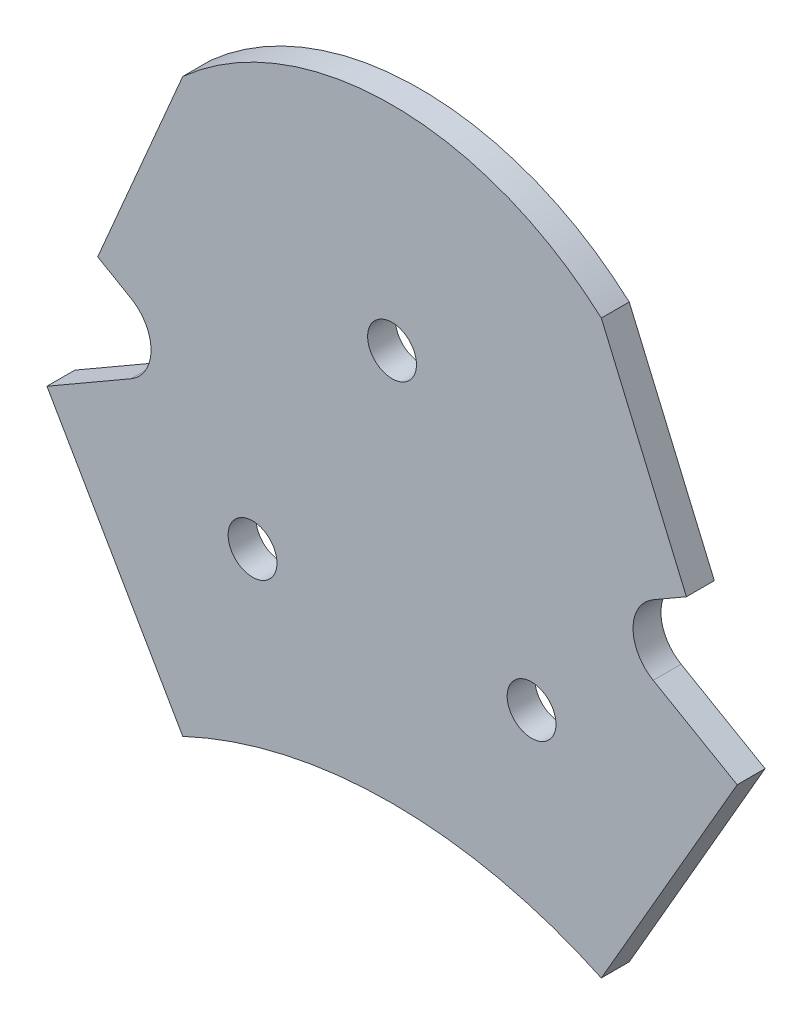
ISO-10303-21;
HEADER;
FILE_DESCRIPTION(('STEP AP214'),'2;1');
FILE_NAME('part.step','',(''),(''),'','','');
FILE_SCHEMA(('AUTOMOTIVE_DESIGN { 1 0 10303 214 1 1 1 1 }'));
ENDSEC;
DATA;
#1=APPLICATION_CONTEXT('core data for automotive mechanical design processes');
#2=APPLICATION_PROTOCOL_DEFINITION('international standard','automotive_design',2000,#1);
#3=PRODUCT_CONTEXT('',#1,'mechanical');
#4=PRODUCT('Part','Part','',(#3));
#5=PRODUCT_RELATED_PRODUCT_CATEGORY('part','',(#4));
#6=PRODUCT_DEFINITION_FORMATION('','',#4);
#7=PRODUCT_DEFINITION_CONTEXT('part definition',#1,'design');
#8=PRODUCT_DEFINITION('design','',#6,#7);
#9=PRODUCT_DEFINITION_SHAPE('','',#8);
#10=(LENGTH_UNIT() NAMED_UNIT(*) SI_UNIT(.MILLI.,.METRE.));
#11=(NAMED_UNIT(*) PLANE_ANGLE_UNIT() SI_UNIT($,.RADIAN.));
#12=(NAMED_UNIT(*) SI_UNIT($,.STERADIAN.) SOLID_ANGLE_UNIT());
#13=UNCERTAINTY_MEASURE_WITH_UNIT(LENGTH_MEASURE(1.E-05),#10,'distance_accuracy_value','');
#14=(GEOMETRIC_REPRESENTATION_CONTEXT(3) GLOBAL_UNCERTAINTY_ASSIGNED_CONTEXT((#13)) GLOBAL_UNIT_ASSIGNED_CONTEXT((#10,
#11,#12)) REPRESENTATION_CONTEXT('',''));
#15=CARTESIAN_POINT('',(0.,0.,0.));
#16=DIRECTION('',(0.,0.,1.));
#17=DIRECTION('',(1.,0.,0.));
#18=AXIS2_PLACEMENT_3D('',#15,#16,#17);
#19=CARTESIAN_POINT('',(0.,8.63401265472819,4.));
#20=DIRECTION('',(0.,0.,-1.));
#21=DIRECTION('',(-1.,0.,0.));
#22=AXIS2_PLACEMENT_3D('',#19,#20,#21);
#23=PLANE('',#22);
#24=DIRECTION('',(-0.866025403784439,0.499999999999999,0.));
#25=VECTOR('',#24,1.);
#26=CARTESIAN_POINT('',(-37.4352447854375,10.8722325026744,4.));
#27=LINE('',#26,#25);
#28=CARTESIAN_POINT('',(-37.4352447854375,10.8722325026744,4.));
#29=VERTEX_POINT('',#28);
#30=CARTESIAN_POINT('',(-42.1983845062519,13.6222325026743,4.));
#31=VERTEX_POINT('',#30);
#32=EDGE_CURVE('E323',#29,#31,#27,.T.);
#33=ORIENTED_EDGE('',*,*,#32,.F.);
#34=CARTESIAN_POINT('',(-40.3219961313856,5.87223250267436,4.));
#35=DIRECTION('',(0.,0.,1.));
#36=DIRECTION('',(1.,0.,0.));
#37=AXIS2_PLACEMENT_3D('',#34,#35,#36);
#38=CIRCLE('',#37,5.77350269189626);
#39=CARTESIAN_POINT('',(-37.4352447854375,0.872232502674344,4.));
#40=VERTEX_POINT('',#39);
#41=EDGE_CURVE('E268',#40,#29,#38,.T.);
#42=ORIENTED_EDGE('',*,*,#41,.F.);
#43=DIRECTION('',(0.866025403784439,0.499999999999999,0.));
#44=VECTOR('',#43,1.);
#45=CARTESIAN_POINT('',(-49.4729978980412,-6.07776749732564,4.));
#46=LINE('',#45,#44);
#47=CARTESIAN_POINT('',(-49.4729978980412,-6.07776749732564,4.));
#48=VERTEX_POINT('',#47);
#49=EDGE_CURVE('E254',#48,#40,#46,.T.);
#50=ORIENTED_EDGE('',*,*,#49,.F.);
#51=DIRECTION('',(-0.5,0.866025403784439,0.));
#52=VECTOR('',#51,1.);
#53=CARTESIAN_POINT('',(-30.,-39.805989232415,4.));
#54=LINE('',#53,#52);
#55=CARTESIAN_POINT('',(-30.,-39.805989232415,4.));
#56=VERTEX_POINT('',#55);
#57=EDGE_CURVE('E267',#56,#48,#54,.T.);
#58=ORIENTED_EDGE('',*,*,#57,.F.);
#59=CARTESIAN_POINT('',(0.,-103.620168336893,4.));
#60=DIRECTION('',(0.,0.,-1.));
#61=DIRECTION('',(-1.,0.,0.));
#62=AXIS2_PLACEMENT_3D('',#59,#60,#61);
#63=CIRCLE('',#62,70.5141791044776);
#64=CARTESIAN_POINT('',(30.,-39.805989232415,4.));
#65=VERTEX_POINT('',#64);
#66=EDGE_CURVE('E274',#56,#65,#63,.T.);
#67=ORIENTED_EDGE('',*,*,#66,.T.);
#68=DIRECTION('',(0.5,0.866025403784439,0.));
#69=VECTOR('',#68,1.);
#70=CARTESIAN_POINT('',(30.,-39.805989232415,4.));
#71=LINE('',#70,#69);
#72=CARTESIAN_POINT('',(49.4729978980412,-6.07776749732566,4.));
#73=VERTEX_POINT('',#72);
#74=EDGE_CURVE('E277',#65,#73,#71,.T.);
#75=ORIENTED_EDGE('',*,*,#74,.T.);
#76=DIRECTION('',(-0.866025403784439,0.5,0.));
#77=VECTOR('',#76,1.);
#78=CARTESIAN_POINT('',(49.4729978980412,-6.07776749732566,4.));
#79=LINE('',#78,#77);
#80=CARTESIAN_POINT('',(37.4352447854375,0.872232502674349,4.));
#81=VERTEX_POINT('',#80);
#82=EDGE_CURVE('E434',#73,#81,#79,.T.);
#83=ORIENTED_EDGE('',*,*,#82,.T.);
#84=CARTESIAN_POINT('',(40.3219961313856,5.87223250267436,4.));
#85=DIRECTION('',(0.,0.,-1.));
#86=DIRECTION('',(-1.,0.,0.));
#87=AXIS2_PLACEMENT_3D('',#84,#85,#86);
#88=CIRCLE('',#87,5.77350269189627);
#89=CARTESIAN_POINT('',(37.4352447854375,10.8722325026744,4.));
#90=VERTEX_POINT('',#89);
#91=EDGE_CURVE('E431',#81,#90,#88,.T.);
#92=ORIENTED_EDGE('',*,*,#91,.T.);
#93=DIRECTION('',(0.866025403784441,0.499999999999996,0.));
#94=VECTOR('',#93,1.);
#95=CARTESIAN_POINT('',(37.4352447854375,10.8722325026744,4.));
#96=LINE('',#95,#94);
#97=CARTESIAN_POINT('',(42.1983845062519,13.6222325026743,4.));
#98=VERTEX_POINT('',#97);
#99=EDGE_CURVE('E428',#90,#98,#96,.T.);
#100=ORIENTED_EDGE('',*,*,#99,.T.);
#101=DIRECTION('',(-0.393496274395222,0.919326210894196,0.));
#102=VECTOR('',#101,1.);
#103=CARTESIAN_POINT('',(42.1983845062519,13.6222325026743,4.));
#104=LINE('',#103,#102);
#105=CARTESIAN_POINT('',(30.,42.1213450403944,4.));
#106=VERTEX_POINT('',#105);
#107=EDGE_CURVE('E425',#98,#106,#104,.T.);
#108=ORIENTED_EDGE('',*,*,#107,.T.);
#109=CARTESIAN_POINT('',(0.,8.63401265472819,4.));
#110=DIRECTION('',(0.,0.,-1.));
#111=DIRECTION('',(-1.,0.,0.));
#112=AXIS2_PLACEMENT_3D('',#109,#110,#111);
#113=CIRCLE('',#112,44.9599981128569);
#114=CARTESIAN_POINT('',(-30.,42.1213450403944,4.));
#115=VERTEX_POINT('',#114);
#116=EDGE_CURVE('E421',#115,#106,#113,.T.);
#117=ORIENTED_EDGE('',*,*,#116,.F.);
#118=DIRECTION('',(0.393496274395222,0.919326210894196,0.));
#119=VECTOR('',#118,1.);
#120=CARTESIAN_POINT('',(-42.1983845062519,13.6222325026743,4.));
#121=LINE('',#120,#119);
#122=EDGE_CURVE('E418',#31,#115,#121,.T.);
#123=ORIENTED_EDGE('',*,*,#122,.F.);
#124=EDGE_LOOP('',(#33,#42,#50,#58,#67,#75,#83,#92,#100,#108,#117,#123));
#125=FACE_BOUND('',#124,.T.);
#126=CARTESIAN_POINT('',(0.,23.094010767585,4.));
#127=DIRECTION('',(0.,0.,1.));
#128=DIRECTION('',(1.,0.,0.));
#129=AXIS2_PLACEMENT_3D('',#126,#127,#128);
#130=CIRCLE('',#129,3.5);
#131=CARTESIAN_POINT('',(3.5,23.094010767585,4.));
#132=VERTEX_POINT('',#131);
#133=EDGE_CURVE('E288',#132,#132,#130,.T.);
#134=ORIENTED_EDGE('',*,*,#133,.F.);
#135=EDGE_LOOP('',(#134));
#136=FACE_BOUND('',#135,.T.);
#137=CARTESIAN_POINT('',(-20.,-11.5470053837925,4.));
#138=DIRECTION('',(0.,0.,1.));
#139=DIRECTION('',(1.,0.,0.));
#140=AXIS2_PLACEMENT_3D('',#137,#138,#139);
#141=CIRCLE('',#140,3.5);
#142=CARTESIAN_POINT('',(-16.5,-11.5470053837925,4.));
#143=VERTEX_POINT('',#142);
#144=EDGE_CURVE('E402',#143,#143,#141,.T.);
#145=ORIENTED_EDGE('',*,*,#144,.F.);
#146=EDGE_LOOP('',(#145));
#147=FACE_BOUND('',#146,.T.);
#148=CARTESIAN_POINT('',(20.,-11.5470053837925,4.));
#149=DIRECTION('',(0.,0.,1.));
#150=DIRECTION('',(1.,0.,0.));
#151=AXIS2_PLACEMENT_3D('',#148,#149,#150);
#152=CIRCLE('',#151,3.5);
#153=CARTESIAN_POINT('',(23.5,-11.5470053837925,4.));
#154=VERTEX_POINT('',#153);
#155=EDGE_CURVE('E391',#154,#154,#152,.T.);
#156=ORIENTED_EDGE('',*,*,#155,.F.);
#157=EDGE_LOOP('',(#156));
#158=FACE_BOUND('',#157,.T.);
#159=ADVANCED_FACE('F156',(#125,#136,#147,#158),#23,.F.);
#160=CARTESIAN_POINT('',(0.,8.63401265472819,0.));
#161=DIRECTION('',(0.,0.,-1.));
#162=DIRECTION('',(-1.,0.,0.));
#163=AXIS2_PLACEMENT_3D('',#160,#161,#162);
#164=PLANE('',#163);
#165=CARTESIAN_POINT('',(-20.,-11.5470053837925,0.));
#166=DIRECTION('',(0.,0.,1.));
#167=DIRECTION('',(1.,0.,0.));
#168=AXIS2_PLACEMENT_3D('',#165,#166,#167);
#169=CIRCLE('',#168,3.5);
#170=CARTESIAN_POINT('',(-16.5,-11.5470053837925,0.));
#171=VERTEX_POINT('',#170);
#172=EDGE_CURVE('E399',#171,#171,#169,.T.);
#173=ORIENTED_EDGE('',*,*,#172,.T.);
#174=EDGE_LOOP('',(#173));
#175=FACE_BOUND('',#174,.T.);
#176=DIRECTION('',(-0.866025403784439,0.499999999999999,0.));
#177=VECTOR('',#176,1.);
#178=CARTESIAN_POINT('',(-37.4352447854375,10.8722325026744,0.));
#179=LINE('',#178,#177);
#180=CARTESIAN_POINT('',(-37.4352447854375,10.8722325026744,0.));
#181=VERTEX_POINT('',#180);
#182=CARTESIAN_POINT('',(-42.1983845062519,13.6222325026743,0.));
#183=VERTEX_POINT('',#182);
#184=EDGE_CURVE('E283',#181,#183,#179,.T.);
#185=ORIENTED_EDGE('',*,*,#184,.T.);
#186=DIRECTION('',(0.393496274395222,0.919326210894196,0.));
#187=VECTOR('',#186,1.);
#188=CARTESIAN_POINT('',(-42.1983845062519,13.6222325026743,0.));
#189=LINE('',#188,#187);
#190=CARTESIAN_POINT('',(-30.,42.1213450403944,0.));
#191=VERTEX_POINT('',#190);
#192=EDGE_CURVE('E287',#183,#191,#189,.T.);
#193=ORIENTED_EDGE('',*,*,#192,.T.);
#194=CARTESIAN_POINT('',(0.,8.63401265472819,0.));
#195=DIRECTION('',(0.,0.,-1.));
#196=DIRECTION('',(-1.,0.,0.));
#197=AXIS2_PLACEMENT_3D('',#194,#195,#196);
#198=CIRCLE('',#197,44.9599981128569);
#199=CARTESIAN_POINT('',(30.,42.1213450403944,0.));
#200=VERTEX_POINT('',#199);
#201=EDGE_CURVE('E292',#191,#200,#198,.T.);
#202=ORIENTED_EDGE('',*,*,#201,.T.);
#203=DIRECTION('',(-0.393496274395222,0.919326210894196,0.));
#204=VECTOR('',#203,1.);
#205=CARTESIAN_POINT('',(42.1983845062519,13.6222325026743,0.));
#206=LINE('',#205,#204);
#207=CARTESIAN_POINT('',(42.1983845062519,13.6222325026743,0.));
#208=VERTEX_POINT('',#207);
#209=EDGE_CURVE('E296',#208,#200,#206,.T.);
#210=ORIENTED_EDGE('',*,*,#209,.F.);
#211=DIRECTION('',(0.866025403784441,0.499999999999996,0.));
#212=VECTOR('',#211,1.);
#213=CARTESIAN_POINT('',(37.4352447854375,10.8722325026744,0.));
#214=LINE('',#213,#212);
#215=CARTESIAN_POINT('',(37.4352447854375,10.8722325026744,0.));
#216=VERTEX_POINT('',#215);
#217=EDGE_CURVE('E300',#216,#208,#214,.T.);
#218=ORIENTED_EDGE('',*,*,#217,.F.);
#219=CARTESIAN_POINT('',(40.3219961313856,5.87223250267436,0.));
#220=DIRECTION('',(0.,0.,-1.));
#221=DIRECTION('',(-1.,0.,0.));
#222=AXIS2_PLACEMENT_3D('',#219,#220,#221);
#223=CIRCLE('',#222,5.77350269189627);
#224=CARTESIAN_POINT('',(37.4352447854375,0.872232502674349,0.));
#225=VERTEX_POINT('',#224);
#226=EDGE_CURVE('E303',#225,#216,#223,.T.);
#227=ORIENTED_EDGE('',*,*,#226,.F.);
#228=DIRECTION('',(-0.866025403784439,0.5,0.));
#229=VECTOR('',#228,1.);
#230=CARTESIAN_POINT('',(49.4729978980412,-6.07776749732566,0.));
#231=LINE('',#230,#229);
#232=CARTESIAN_POINT('',(49.4729978980412,-6.07776749732566,0.));
#233=VERTEX_POINT('',#232);
#234=EDGE_CURVE('E306',#233,#225,#231,.T.);
#235=ORIENTED_EDGE('',*,*,#234,.F.);
#236=DIRECTION('',(0.5,0.866025403784439,0.));
#237=VECTOR('',#236,1.);
#238=CARTESIAN_POINT('',(30.,-39.805989232415,0.));
#239=LINE('',#238,#237);
#240=CARTESIAN_POINT('',(30.,-39.805989232415,0.));
#241=VERTEX_POINT('',#240);
#242=EDGE_CURVE('E309',#241,#233,#239,.T.);
#243=ORIENTED_EDGE('',*,*,#242,.F.);
#244=CARTESIAN_POINT('',(0.,-103.620168336893,0.));
#245=DIRECTION('',(0.,0.,-1.));
#246=DIRECTION('',(-1.,0.,0.));
#247=AXIS2_PLACEMENT_3D('',#244,#245,#246);
#248=CIRCLE('',#247,70.5141791044776);
#249=CARTESIAN_POINT('',(-30.,-39.805989232415,0.));
#250=VERTEX_POINT('',#249);
#251=EDGE_CURVE('E312',#250,#241,#248,.T.);
#252=ORIENTED_EDGE('',*,*,#251,.F.);
#253=DIRECTION('',(-0.5,0.866025403784439,0.));
#254=VECTOR('',#253,1.);
#255=CARTESIAN_POINT('',(-30.,-39.805989232415,0.));
#256=LINE('',#255,#254);
#257=CARTESIAN_POINT('',(-49.4729978980412,-6.07776749732564,0.));
#258=VERTEX_POINT('',#257);
#259=EDGE_CURVE('E315',#250,#258,#256,.T.);
#260=ORIENTED_EDGE('',*,*,#259,.T.);
#261=DIRECTION('',(0.866025403784439,0.499999999999999,0.));
#262=VECTOR('',#261,1.);
#263=CARTESIAN_POINT('',(-49.4729978980412,-6.07776749732564,0.));
#264=LINE('',#263,#262);
#265=CARTESIAN_POINT('',(-37.4352447854375,0.872232502674344,0.));
#266=VERTEX_POINT('',#265);
#267=EDGE_CURVE('E256',#258,#266,#264,.T.);
#268=ORIENTED_EDGE('',*,*,#267,.T.);
#269=CARTESIAN_POINT('',(-40.3219961313856,5.87223250267436,0.));
#270=DIRECTION('',(0.,0.,1.));
#271=DIRECTION('',(1.,0.,0.));
#272=AXIS2_PLACEMENT_3D('',#269,#270,#271);
#273=CIRCLE('',#272,5.77350269189626);
#274=EDGE_CURVE('E320',#266,#181,#273,.T.);
#275=ORIENTED_EDGE('',*,*,#274,.T.);
#276=EDGE_LOOP('',(#185,#193,#202,#210,#218,#227,#235,#243,#252,#260,#268,#275));
#277=FACE_BOUND('',#276,.T.);
#278=CARTESIAN_POINT('',(0.,23.094010767585,0.));
#279=DIRECTION('',(0.,0.,1.));
#280=DIRECTION('',(1.,0.,0.));
#281=AXIS2_PLACEMENT_3D('',#278,#279,#280);
#282=CIRCLE('',#281,3.5);
#283=CARTESIAN_POINT('',(3.5,23.094010767585,0.));
#284=VERTEX_POINT('',#283);
#285=EDGE_CURVE('E406',#284,#284,#282,.T.);
#286=ORIENTED_EDGE('',*,*,#285,.T.);
#287=EDGE_LOOP('',(#286));
#288=FACE_BOUND('',#287,.T.);
#289=CARTESIAN_POINT('',(20.,-11.5470053837925,0.));
#290=DIRECTION('',(0.,0.,1.));
#291=DIRECTION('',(1.,0.,0.));
#292=AXIS2_PLACEMENT_3D('',#289,#290,#291);
#293=CIRCLE('',#292,3.5);
#294=CARTESIAN_POINT('',(23.5,-11.5470053837925,0.));
#295=VERTEX_POINT('',#294);
#296=EDGE_CURVE('E394',#295,#295,#293,.T.);
#297=ORIENTED_EDGE('',*,*,#296,.T.);
#298=EDGE_LOOP('',(#297));
#299=FACE_BOUND('',#298,.T.);
#300=ADVANCED_FACE('F357',(#175,#277,#288,#299),#164,.T.);
#301=CARTESIAN_POINT('',(-37.4352447854375,10.8722325026744,4.));
#302=DIRECTION('',(-0.499999999999999,-0.866025403784439,0.));
#303=DIRECTION('',(0.866025403784439,-0.499999999999999,0.));
#304=AXIS2_PLACEMENT_3D('',#301,#302,#303);
#305=PLANE('',#304);
#306=ORIENTED_EDGE('',*,*,#184,.F.);
#307=DIRECTION('',(0.,0.,-1.));
#308=VECTOR('',#307,1.);
#309=CARTESIAN_POINT('',(-37.4352447854375,10.8722325026744,4.));
#310=LINE('',#309,#308);
#311=EDGE_CURVE('E12',#29,#181,#310,.T.);
#312=ORIENTED_EDGE('',*,*,#311,.F.);
#313=ORIENTED_EDGE('',*,*,#32,.T.);
#314=DIRECTION('',(0.,0.,-1.));
#315=VECTOR('',#314,1.);
#316=CARTESIAN_POINT('',(-42.1983845062519,13.6222325026743,4.));
#317=LINE('',#316,#315);
#318=EDGE_CURVE('E160',#31,#183,#317,.T.);
#319=ORIENTED_EDGE('',*,*,#318,.T.);
#320=EDGE_LOOP('',(#306,#312,#313,#319));
#321=FACE_BOUND('',#320,.T.);
#322=ADVANCED_FACE('F158',(#321),#305,.T.);
#323=CARTESIAN_POINT('',(-40.3219961313856,5.87223250267436,4.));
#324=DIRECTION('',(0.,0.,-1.));
#325=DIRECTION('',(-1.,0.,0.));
#326=AXIS2_PLACEMENT_3D('',#323,#324,#325);
#327=CYLINDRICAL_SURFACE('',#326,5.77350269189626);
#328=ORIENTED_EDGE('',*,*,#274,.F.);
#329=DIRECTION('',(0.,0.,-1.));
#330=VECTOR('',#329,1.);
#331=CARTESIAN_POINT('',(-37.4352447854375,0.872232502674344,4.));
#332=LINE('',#331,#330);
#333=EDGE_CURVE('E167',#40,#266,#332,.T.);
#334=ORIENTED_EDGE('',*,*,#333,.F.);
#335=ORIENTED_EDGE('',*,*,#41,.T.);
#336=ORIENTED_EDGE('',*,*,#311,.T.);
#337=EDGE_LOOP('',(#328,#334,#335,#336));
#338=FACE_BOUND('',#337,.T.);
#339=ADVANCED_FACE('F359',(#338),#327,.F.);
#340=CARTESIAN_POINT('',(-49.4729978980412,-6.07776749732564,4.));
#341=DIRECTION('',(-0.5,0.866025403784439,0.));
#342=DIRECTION('',(-0.866025403784439,-0.499999999999999,0.));
#343=AXIS2_PLACEMENT_3D('',#340,#341,#342);
#344=PLANE('',#343);
#345=ORIENTED_EDGE('',*,*,#267,.F.);
#346=DIRECTION('',(0.,0.,-1.));
#347=VECTOR('',#346,1.);
#348=CARTESIAN_POINT('',(-49.4729978980412,-6.07776749732564,4.));
#349=LINE('',#348,#347);
#350=EDGE_CURVE('E251',#48,#258,#349,.T.);
#351=ORIENTED_EDGE('',*,*,#350,.F.);
#352=ORIENTED_EDGE('',*,*,#49,.T.);
#353=ORIENTED_EDGE('',*,*,#333,.T.);
#354=EDGE_LOOP('',(#345,#351,#352,#353));
#355=FACE_BOUND('',#354,.T.);
#356=ADVANCED_FACE('F253',(#355),#344,.T.);
#357=CARTESIAN_POINT('',(-30.,-39.805989232415,4.));
#358=DIRECTION('',(-0.866025403784439,-0.5,0.));
#359=DIRECTION('',(0.5,-0.866025403784439,0.));
#360=AXIS2_PLACEMENT_3D('',#357,#358,#359);
#361=PLANE('',#360);
#362=ORIENTED_EDGE('',*,*,#259,.F.);
#363=DIRECTION('',(0.,0.,-1.));
#364=VECTOR('',#363,1.);
#365=CARTESIAN_POINT('',(-30.,-39.805989232415,4.));
#366=LINE('',#365,#364);
#367=EDGE_CURVE('E262',#56,#250,#366,.T.);
#368=ORIENTED_EDGE('',*,*,#367,.F.);
#369=ORIENTED_EDGE('',*,*,#57,.T.);
#370=ORIENTED_EDGE('',*,*,#350,.T.);
#371=EDGE_LOOP('',(#362,#368,#369,#370));
#372=FACE_BOUND('',#371,.T.);
#373=ADVANCED_FACE('F271',(#372),#361,.T.);
#374=CARTESIAN_POINT('',(0.,-103.620168336893,4.));
#375=DIRECTION('',(0.,0.,-1.));
#376=DIRECTION('',(-1.,0.,0.));
#377=AXIS2_PLACEMENT_3D('',#374,#375,#376);
#378=CYLINDRICAL_SURFACE('',#377,70.5141791044776);
#379=ORIENTED_EDGE('',*,*,#251,.T.);
#380=DIRECTION('',(0.,0.,-1.));
#381=VECTOR('',#380,1.);
#382=CARTESIAN_POINT('',(30.,-39.805989232415,4.));
#383=LINE('',#382,#381);
#384=EDGE_CURVE('E329',#65,#241,#383,.T.);
#385=ORIENTED_EDGE('',*,*,#384,.F.);
#386=ORIENTED_EDGE('',*,*,#66,.F.);
#387=ORIENTED_EDGE('',*,*,#367,.T.);
#388=EDGE_LOOP('',(#379,#385,#386,#387));
#389=FACE_BOUND('',#388,.T.);
#390=ADVANCED_FACE('F468',(#389),#378,.F.);
#391=CARTESIAN_POINT('',(30.,-39.805989232415,4.));
#392=DIRECTION('',(-0.866025403784439,0.5,0.));
#393=DIRECTION('',(-0.5,-0.866025403784439,0.));
#394=AXIS2_PLACEMENT_3D('',#391,#392,#393);
#395=PLANE('',#394);
#396=ORIENTED_EDGE('',*,*,#242,.T.);
#397=DIRECTION('',(0.,0.,-1.));
#398=VECTOR('',#397,1.);
#399=CARTESIAN_POINT('',(49.4729978980412,-6.07776749732566,4.));
#400=LINE('',#399,#398);
#401=EDGE_CURVE('E333',#73,#233,#400,.T.);
#402=ORIENTED_EDGE('',*,*,#401,.F.);
#403=ORIENTED_EDGE('',*,*,#74,.F.);
#404=ORIENTED_EDGE('',*,*,#384,.T.);
#405=EDGE_LOOP('',(#396,#402,#403,#404));
#406=FACE_BOUND('',#405,.T.);
#407=ADVANCED_FACE('F443',(#406),#395,.F.);
#408=CARTESIAN_POINT('',(49.4729978980412,-6.07776749732566,4.));
#409=DIRECTION('',(-0.5,-0.866025403784439,0.));
#410=DIRECTION('',(0.866025403784439,-0.5,0.));
#411=AXIS2_PLACEMENT_3D('',#408,#409,#410);
#412=PLANE('',#411);
#413=ORIENTED_EDGE('',*,*,#234,.T.);
#414=DIRECTION('',(0.,0.,-1.));
#415=VECTOR('',#414,1.);
#416=CARTESIAN_POINT('',(37.4352447854375,0.872232502674349,4.));
#417=LINE('',#416,#415);
#418=EDGE_CURVE('E337',#81,#225,#417,.T.);
#419=ORIENTED_EDGE('',*,*,#418,.F.);
#420=ORIENTED_EDGE('',*,*,#82,.F.);
#421=ORIENTED_EDGE('',*,*,#401,.T.);
#422=EDGE_LOOP('',(#413,#419,#420,#421));
#423=FACE_BOUND('',#422,.T.);
#424=ADVANCED_FACE('F447',(#423),#412,.F.);
#425=CARTESIAN_POINT('',(40.3219961313856,5.87223250267436,4.));
#426=DIRECTION('',(0.,0.,-1.));
#427=DIRECTION('',(-1.,0.,0.));
#428=AXIS2_PLACEMENT_3D('',#425,#426,#427);
#429=CYLINDRICAL_SURFACE('',#428,5.77350269189627);
#430=ORIENTED_EDGE('',*,*,#226,.T.);
#431=DIRECTION('',(0.,0.,-1.));
#432=VECTOR('',#431,1.);
#433=CARTESIAN_POINT('',(37.4352447854375,10.8722325026744,4.));
#434=LINE('',#433,#432);
#435=EDGE_CURVE('E341',#90,#216,#434,.T.);
#436=ORIENTED_EDGE('',*,*,#435,.F.);
#437=ORIENTED_EDGE('',*,*,#91,.F.);
#438=ORIENTED_EDGE('',*,*,#418,.T.);
#439=EDGE_LOOP('',(#430,#436,#437,#438));
#440=FACE_BOUND('',#439,.T.);
#441=ADVANCED_FACE('F452',(#440),#429,.F.);
#442=CARTESIAN_POINT('',(37.4352447854375,10.8722325026744,4.));
#443=DIRECTION('',(-0.499999999999996,0.866025403784441,0.));
#444=DIRECTION('',(-0.866025403784441,-0.499999999999996,0.));
#445=AXIS2_PLACEMENT_3D('',#442,#443,#444);
#446=PLANE('',#445);
#447=ORIENTED_EDGE('',*,*,#217,.T.);
#448=DIRECTION('',(0.,0.,-1.));
#449=VECTOR('',#448,1.);
#450=CARTESIAN_POINT('',(42.1983845062519,13.6222325026743,4.));
#451=LINE('',#450,#449);
#452=EDGE_CURVE('E345',#98,#208,#451,.T.);
#453=ORIENTED_EDGE('',*,*,#452,.F.);
#454=ORIENTED_EDGE('',*,*,#99,.F.);
#455=ORIENTED_EDGE('',*,*,#435,.T.);
#456=EDGE_LOOP('',(#447,#453,#454,#455));
#457=FACE_BOUND('',#456,.T.);
#458=ADVANCED_FACE('F459',(#457),#446,.F.);
#459=CARTESIAN_POINT('',(42.1983845062519,13.6222325026743,4.));
#460=DIRECTION('',(-0.919326210894196,-0.393496274395222,0.));
#461=DIRECTION('',(0.393496274395222,-0.919326210894196,0.));
#462=AXIS2_PLACEMENT_3D('',#459,#460,#461);
#463=PLANE('',#462);
#464=ORIENTED_EDGE('',*,*,#209,.T.);
#465=DIRECTION('',(0.,0.,-1.));
#466=VECTOR('',#465,1.);
#467=CARTESIAN_POINT('',(30.,42.1213450403944,4.));
#468=LINE('',#467,#466);
#469=EDGE_CURVE('E349',#106,#200,#468,.T.);
#470=ORIENTED_EDGE('',*,*,#469,.F.);
#471=ORIENTED_EDGE('',*,*,#107,.F.);
#472=ORIENTED_EDGE('',*,*,#452,.T.);
#473=EDGE_LOOP('',(#464,#470,#471,#472));
#474=FACE_BOUND('',#473,.T.);
#475=ADVANCED_FACE('F463',(#474),#463,.F.);
#476=CARTESIAN_POINT('',(0.,8.63401265472819,4.));
#477=DIRECTION('',(0.,0.,-1.));
#478=DIRECTION('',(-1.,0.,0.));
#479=AXIS2_PLACEMENT_3D('',#476,#477,#478);
#480=CYLINDRICAL_SURFACE('',#479,44.9599981128569);
#481=ORIENTED_EDGE('',*,*,#201,.F.);
#482=DIRECTION('',(0.,0.,-1.));
#483=VECTOR('',#482,1.);
#484=CARTESIAN_POINT('',(-30.,42.1213450403944,4.));
#485=LINE('',#484,#483);
#486=EDGE_CURVE('E351',#115,#191,#485,.T.);
#487=ORIENTED_EDGE('',*,*,#486,.F.);
#488=ORIENTED_EDGE('',*,*,#116,.T.);
#489=ORIENTED_EDGE('',*,*,#469,.T.);
#490=EDGE_LOOP('',(#481,#487,#488,#489));
#491=FACE_BOUND('',#490,.T.);
#492=ADVANCED_FACE('F465',(#491),#480,.T.);
#493=CARTESIAN_POINT('',(-42.1983845062519,13.6222325026743,4.));
#494=DIRECTION('',(-0.919326210894196,0.393496274395222,0.));
#495=DIRECTION('',(-0.393496274395222,-0.919326210894196,0.));
#496=AXIS2_PLACEMENT_3D('',#493,#494,#495);
#497=PLANE('',#496);
#498=ORIENTED_EDGE('',*,*,#192,.F.);
#499=ORIENTED_EDGE('',*,*,#318,.F.);
#500=ORIENTED_EDGE('',*,*,#122,.T.);
#501=ORIENTED_EDGE('',*,*,#486,.T.);
#502=EDGE_LOOP('',(#498,#499,#500,#501));
#503=FACE_BOUND('',#502,.T.);
#504=ADVANCED_FACE('F355',(#503),#497,.T.);
#505=CARTESIAN_POINT('',(0.,23.094010767585,4.));
#506=DIRECTION('',(0.,0.,-1.));
#507=DIRECTION('',(-1.,0.,0.));
#508=AXIS2_PLACEMENT_3D('',#505,#506,#507);
#509=CYLINDRICAL_SURFACE('',#508,3.5);
#510=ORIENTED_EDGE('',*,*,#133,.T.);
#511=EDGE_LOOP('',(#510));
#512=FACE_BOUND('',#511,.T.);
#513=ORIENTED_EDGE('',*,*,#285,.F.);
#514=EDGE_LOOP('',(#513));
#515=FACE_BOUND('',#514,.T.);
#516=ADVANCED_FACE('F375',(#512,#515),#509,.F.);
#517=CARTESIAN_POINT('',(-20.,-11.5470053837925,4.));
#518=DIRECTION('',(0.,0.,-1.));
#519=DIRECTION('',(-1.,0.,0.));
#520=AXIS2_PLACEMENT_3D('',#517,#518,#519);
#521=CYLINDRICAL_SURFACE('',#520,3.5);
#522=ORIENTED_EDGE('',*,*,#144,.T.);
#523=EDGE_LOOP('',(#522));
#524=FACE_BOUND('',#523,.T.);
#525=ORIENTED_EDGE('',*,*,#172,.F.);
#526=EDGE_LOOP('',(#525));
#527=FACE_BOUND('',#526,.T.);
#528=ADVANCED_FACE('F378',(#524,#527),#521,.F.);
#529=CARTESIAN_POINT('',(20.,-11.5470053837925,4.));
#530=DIRECTION('',(0.,0.,-1.));
#531=DIRECTION('',(-1.,0.,0.));
#532=AXIS2_PLACEMENT_3D('',#529,#530,#531);
#533=CYLINDRICAL_SURFACE('',#532,3.5);
#534=ORIENTED_EDGE('',*,*,#155,.T.);
#535=EDGE_LOOP('',(#534));
#536=FACE_BOUND('',#535,.T.);
#537=ORIENTED_EDGE('',*,*,#296,.F.);
#538=EDGE_LOOP('',(#537));
#539=FACE_BOUND('',#538,.T.);
#540=ADVANCED_FACE('F382',(#536,#539),#533,.F.);
#541=CLOSED_SHELL('',(#159,#300,#322,#339,#356,#373,#390,#407,#424,#441,#458,#475,#492,#504,
#516,#528,#540));
#542=MANIFOLD_SOLID_BREP('B2',#541);
#543=ADVANCED_BREP_SHAPE_REPRESENTATION('',(#18,#542),#14);
#544=SHAPE_DEFINITION_REPRESENTATION(#9,#543);
ENDSEC;
END-ISO-10303-21;
